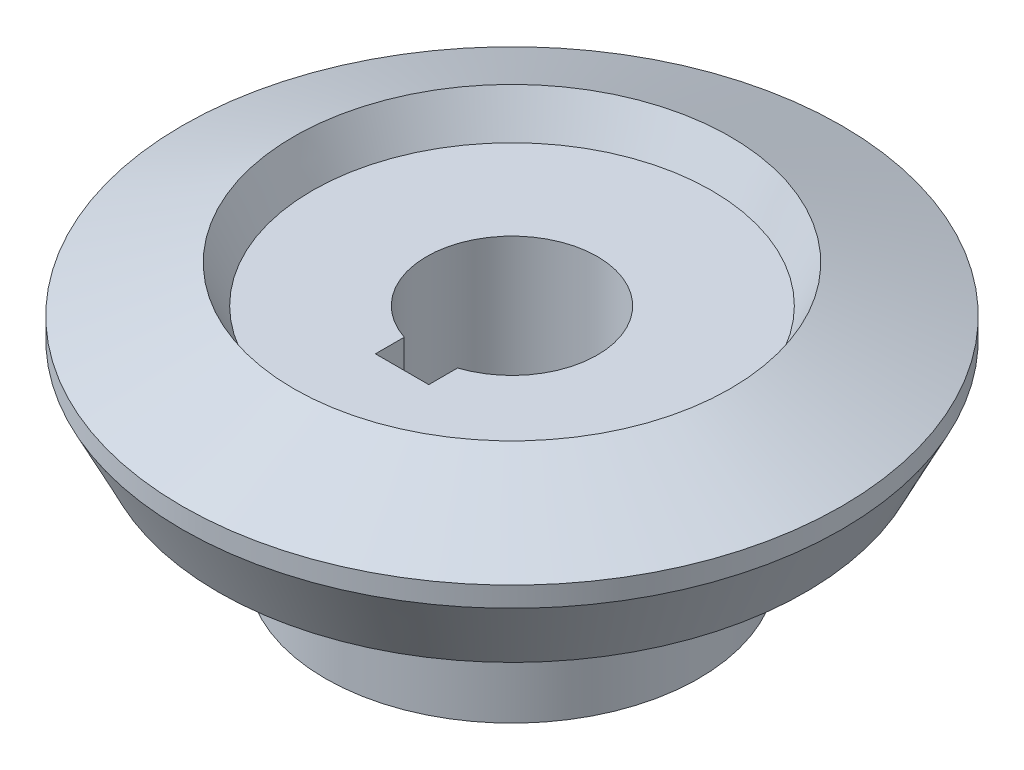
ISO-10303-21;
HEADER;
FILE_DESCRIPTION(('STEP AP214'),'2;1');
FILE_NAME('part.step','',(''),(''),'','','');
FILE_SCHEMA(('AUTOMOTIVE_DESIGN { 1 0 10303 214 1 1 1 1 }'));
ENDSEC;
DATA;
#1=APPLICATION_CONTEXT('core data for automotive mechanical design processes');
#2=APPLICATION_PROTOCOL_DEFINITION('international standard','automotive_design',2000,#1);
#3=PRODUCT_CONTEXT('',#1,'mechanical');
#4=PRODUCT('Part','Part','',(#3));
#5=PRODUCT_RELATED_PRODUCT_CATEGORY('part','',(#4));
#6=PRODUCT_DEFINITION_FORMATION('','',#4);
#7=PRODUCT_DEFINITION_CONTEXT('part definition',#1,'design');
#8=PRODUCT_DEFINITION('design','',#6,#7);
#9=PRODUCT_DEFINITION_SHAPE('','',#8);
#10=(LENGTH_UNIT() NAMED_UNIT(*) SI_UNIT(.MILLI.,.METRE.));
#11=(NAMED_UNIT(*) PLANE_ANGLE_UNIT() SI_UNIT($,.RADIAN.));
#12=(NAMED_UNIT(*) SI_UNIT($,.STERADIAN.) SOLID_ANGLE_UNIT());
#13=UNCERTAINTY_MEASURE_WITH_UNIT(LENGTH_MEASURE(1.E-05),#10,'distance_accuracy_value','');
#14=(GEOMETRIC_REPRESENTATION_CONTEXT(3) GLOBAL_UNCERTAINTY_ASSIGNED_CONTEXT((#13)) GLOBAL_UNIT_ASSIGNED_CONTEXT((#10,
#11,#12)) REPRESENTATION_CONTEXT('',''));
#15=CARTESIAN_POINT('',(0.,0.,0.));
#16=DIRECTION('',(0.,0.,1.));
#17=DIRECTION('',(1.,0.,0.));
#18=AXIS2_PLACEMENT_3D('',#15,#16,#17);
#19=CARTESIAN_POINT('',(0.,6.,0.));
#20=DIRECTION('',(0.,1.,0.));
#21=DIRECTION('',(0.,0.,1.));
#22=AXIS2_PLACEMENT_3D('',#19,#20,#21);
#23=CYLINDRICAL_SURFACE('',#22,17.5);
#24=CARTESIAN_POINT('',(0.,0.,0.));
#25=DIRECTION('',(0.,1.,0.));
#26=DIRECTION('',(0.,0.,1.));
#27=AXIS2_PLACEMENT_3D('',#24,#25,#26);
#28=CIRCLE('',#27,17.5);
#29=CARTESIAN_POINT('',(0.,0.,17.5));
#30=VERTEX_POINT('',#29);
#31=EDGE_CURVE('E20',#30,#30,#28,.F.);
#32=ORIENTED_EDGE('',*,*,#31,.F.);
#33=EDGE_LOOP('',(#32));
#34=FACE_BOUND('',#33,.T.);
#35=CARTESIAN_POINT('',(0.,12.,0.));
#36=DIRECTION('',(0.,1.,0.));
#37=DIRECTION('',(0.,0.,1.));
#38=AXIS2_PLACEMENT_3D('',#35,#36,#37);
#39=CIRCLE('',#38,17.5);
#40=CARTESIAN_POINT('',(0.,12.,17.5));
#41=VERTEX_POINT('',#40);
#42=EDGE_CURVE('E74',#41,#41,#39,.T.);
#43=ORIENTED_EDGE('',*,*,#42,.F.);
#44=EDGE_LOOP('',(#43));
#45=FACE_BOUND('',#44,.T.);
#46=ADVANCED_FACE('F17',(#34,#45),#23,.T.);
#47=CARTESIAN_POINT('',(17.5,0.,0.));
#48=DIRECTION('',(0.,-1.,0.));
#49=DIRECTION('',(0.,0.,-1.));
#50=AXIS2_PLACEMENT_3D('',#47,#48,#49);
#51=PLANE('',#50);
#52=DIRECTION('',(0.,0.,-1.));
#53=VECTOR('',#52,1.);
#54=CARTESIAN_POINT('',(2.5,0.,10.3));
#55=LINE('',#54,#53);
#56=CARTESIAN_POINT('',(2.5,0.,10.3));
#57=VERTEX_POINT('',#56);
#58=CARTESIAN_POINT('',(2.5,0.,7.59934207678533));
#59=VERTEX_POINT('',#58);
#60=EDGE_CURVE('E55',#57,#59,#55,.T.);
#61=ORIENTED_EDGE('',*,*,#60,.T.);
#62=CARTESIAN_POINT('',(0.,0.,0.));
#63=DIRECTION('',(0.,1.,0.));
#64=DIRECTION('',(0.,0.,1.));
#65=AXIS2_PLACEMENT_3D('',#62,#63,#64);
#66=CIRCLE('',#65,8.);
#67=CARTESIAN_POINT('',(-2.5,0.,7.59934207678533));
#68=VERTEX_POINT('',#67);
#69=EDGE_CURVE('E57',#59,#68,#66,.T.);
#70=ORIENTED_EDGE('',*,*,#69,.T.);
#71=DIRECTION('',(0.,0.,1.));
#72=VECTOR('',#71,1.);
#73=CARTESIAN_POINT('',(-2.5,0.,7.59934207678533));
#74=LINE('',#73,#72);
#75=CARTESIAN_POINT('',(-2.5,0.,10.3));
#76=VERTEX_POINT('',#75);
#77=EDGE_CURVE('E61',#68,#76,#74,.T.);
#78=ORIENTED_EDGE('',*,*,#77,.T.);
#79=DIRECTION('',(1.,0.,0.));
#80=VECTOR('',#79,1.);
#81=CARTESIAN_POINT('',(-2.5,0.,10.3));
#82=LINE('',#81,#80);
#83=EDGE_CURVE('E88',#76,#57,#82,.T.);
#84=ORIENTED_EDGE('',*,*,#83,.T.);
#85=EDGE_LOOP('',(#61,#70,#78,#84));
#86=FACE_BOUND('',#85,.T.);
#87=ORIENTED_EDGE('',*,*,#31,.T.);
#88=EDGE_LOOP('',(#87));
#89=FACE_BOUND('',#88,.T.);
#90=ADVANCED_FACE('F59',(#86,#89),#51,.T.);
#91=CARTESIAN_POINT('',(27.5,12.,0.));
#92=DIRECTION('',(0.,-1.,0.));
#93=DIRECTION('',(0.,0.,-1.));
#94=AXIS2_PLACEMENT_3D('',#91,#92,#93);
#95=PLANE('',#94);
#96=ORIENTED_EDGE('',*,*,#42,.T.);
#97=EDGE_LOOP('',(#96));
#98=FACE_BOUND('',#97,.T.);
#99=CARTESIAN_POINT('',(0.,12.,0.));
#100=DIRECTION('',(0.,1.,0.));
#101=DIRECTION('',(0.,0.,1.));
#102=AXIS2_PLACEMENT_3D('',#99,#100,#101);
#103=CIRCLE('',#102,27.5);
#104=CARTESIAN_POINT('',(0.,12.,27.5));
#105=VERTEX_POINT('',#104);
#106=EDGE_CURVE('E105',#105,#105,#103,.T.);
#107=ORIENTED_EDGE('',*,*,#106,.F.);
#108=EDGE_LOOP('',(#107));
#109=FACE_BOUND('',#108,.T.);
#110=ADVANCED_FACE('F119',(#98,#109),#95,.T.);
#111=CARTESIAN_POINT('',(-2.5,0.,7.59934207678533));
#112=DIRECTION('',(-1.,0.,0.));
#113=DIRECTION('',(0.,0.,1.));
#114=AXIS2_PLACEMENT_3D('',#111,#112,#113);
#115=PLANE('',#114);
#116=DIRECTION('',(0.,1.,0.));
#117=VECTOR('',#116,1.);
#118=CARTESIAN_POINT('',(-2.5,0.,10.3));
#119=LINE('',#118,#117);
#120=CARTESIAN_POINT('',(-2.5,21.5,10.3));
#121=VERTEX_POINT('',#120);
#122=EDGE_CURVE('E72',#121,#76,#119,.F.);
#123=ORIENTED_EDGE('',*,*,#122,.T.);
#124=ORIENTED_EDGE('',*,*,#77,.F.);
#125=DIRECTION('',(0.,1.,0.));
#126=VECTOR('',#125,1.);
#127=CARTESIAN_POINT('',(-2.5,0.,7.59934207678533));
#128=LINE('',#127,#126);
#129=CARTESIAN_POINT('',(-2.5,21.5,7.59934207678533));
#130=VERTEX_POINT('',#129);
#131=EDGE_CURVE('E66',#68,#130,#128,.T.);
#132=ORIENTED_EDGE('',*,*,#131,.T.);
#133=DIRECTION('',(0.,0.,1.));
#134=VECTOR('',#133,1.);
#135=CARTESIAN_POINT('',(-2.5,21.5,0.));
#136=LINE('',#135,#134);
#137=EDGE_CURVE('E104',#121,#130,#136,.F.);
#138=ORIENTED_EDGE('',*,*,#137,.F.);
#139=EDGE_LOOP('',(#123,#124,#132,#138));
#140=FACE_BOUND('',#139,.T.);
#141=ADVANCED_FACE('F69',(#140),#115,.F.);
#142=CARTESIAN_POINT('',(0.,0.,0.));
#143=DIRECTION('',(0.,1.,0.));
#144=DIRECTION('',(0.,0.,1.));
#145=AXIS2_PLACEMENT_3D('',#142,#143,#144);
#146=CYLINDRICAL_SURFACE('',#145,8.);
#147=ORIENTED_EDGE('',*,*,#131,.F.);
#148=ORIENTED_EDGE('',*,*,#69,.F.);
#149=DIRECTION('',(0.,1.,0.));
#150=VECTOR('',#149,1.);
#151=CARTESIAN_POINT('',(2.5,0.,7.59934207678533));
#152=LINE('',#151,#150);
#153=CARTESIAN_POINT('',(2.5,21.5,7.59934207678533));
#154=VERTEX_POINT('',#153);
#155=EDGE_CURVE('E81',#59,#154,#152,.T.);
#156=ORIENTED_EDGE('',*,*,#155,.T.);
#157=CARTESIAN_POINT('',(0.,21.5,0.));
#158=DIRECTION('',(0.,1.,0.));
#159=DIRECTION('',(0.,0.,1.));
#160=AXIS2_PLACEMENT_3D('',#157,#158,#159);
#161=CIRCLE('',#160,8.);
#162=EDGE_CURVE('E78',#130,#154,#161,.F.);
#163=ORIENTED_EDGE('',*,*,#162,.F.);
#164=EDGE_LOOP('',(#147,#148,#156,#163));
#165=FACE_BOUND('',#164,.T.);
#166=ADVANCED_FACE('F76',(#165),#146,.F.);
#167=CARTESIAN_POINT('',(2.5,0.,10.3));
#168=DIRECTION('',(1.,0.,0.));
#169=DIRECTION('',(0.,0.,-1.));
#170=AXIS2_PLACEMENT_3D('',#167,#168,#169);
#171=PLANE('',#170);
#172=ORIENTED_EDGE('',*,*,#155,.F.);
#173=ORIENTED_EDGE('',*,*,#60,.F.);
#174=DIRECTION('',(0.,1.,0.));
#175=VECTOR('',#174,1.);
#176=CARTESIAN_POINT('',(2.5,0.,10.3));
#177=LINE('',#176,#175);
#178=CARTESIAN_POINT('',(2.5,21.5,10.3));
#179=VERTEX_POINT('',#178);
#180=EDGE_CURVE('E35',#57,#179,#177,.T.);
#181=ORIENTED_EDGE('',*,*,#180,.T.);
#182=DIRECTION('',(0.,0.,1.));
#183=VECTOR('',#182,1.);
#184=CARTESIAN_POINT('',(2.5,21.5,0.));
#185=LINE('',#184,#183);
#186=EDGE_CURVE('E103',#154,#179,#185,.T.);
#187=ORIENTED_EDGE('',*,*,#186,.F.);
#188=EDGE_LOOP('',(#172,#173,#181,#187));
#189=FACE_BOUND('',#188,.T.);
#190=ADVANCED_FACE('F147',(#189),#171,.F.);
#191=CARTESIAN_POINT('',(-2.5,0.,10.3));
#192=DIRECTION('',(0.,0.,1.));
#193=DIRECTION('',(1.,0.,0.));
#194=AXIS2_PLACEMENT_3D('',#191,#192,#193);
#195=PLANE('',#194);
#196=ORIENTED_EDGE('',*,*,#180,.F.);
#197=ORIENTED_EDGE('',*,*,#83,.F.);
#198=ORIENTED_EDGE('',*,*,#122,.F.);
#199=DIRECTION('',(1.,0.,0.));
#200=VECTOR('',#199,1.);
#201=CARTESIAN_POINT('',(0.,21.5,10.3));
#202=LINE('',#201,#200);
#203=EDGE_CURVE('E163',#179,#121,#202,.F.);
#204=ORIENTED_EDGE('',*,*,#203,.F.);
#205=EDGE_LOOP('',(#196,#197,#198,#204));
#206=FACE_BOUND('',#205,.T.);
#207=ADVANCED_FACE('F143',(#206),#195,.F.);
#208=CARTESIAN_POINT('',(0.,18.790000348733,0.));
#209=DIRECTION('',(0.,1.,0.));
#210=DIRECTION('',(0.,0.,1.));
#211=AXIS2_PLACEMENT_3D('',#208,#209,#210);
#212=CONICAL_SURFACE('',#211,30.895,0.46364758845689);
#213=ORIENTED_EDGE('',*,*,#106,.T.);
#214=EDGE_LOOP('',(#213));
#215=FACE_BOUND('',#214,.T.);
#216=CARTESIAN_POINT('',(0.,18.790000348733,0.));
#217=DIRECTION('',(0.,1.,0.));
#218=DIRECTION('',(0.,0.,1.));
#219=AXIS2_PLACEMENT_3D('',#216,#217,#218);
#220=CIRCLE('',#219,30.895);
#221=CARTESIAN_POINT('',(0.,18.790000348733,30.895));
#222=VERTEX_POINT('',#221);
#223=EDGE_CURVE('E101',#222,#222,#220,.T.);
#224=ORIENTED_EDGE('',*,*,#223,.F.);
#225=EDGE_LOOP('',(#224));
#226=FACE_BOUND('',#225,.T.);
#227=ADVANCED_FACE('F139',(#215,#226),#212,.T.);
#228=CARTESIAN_POINT('',(0.,21.5,0.));
#229=DIRECTION('',(0.,1.,0.));
#230=DIRECTION('',(0.,0.,1.));
#231=AXIS2_PLACEMENT_3D('',#228,#229,#230);
#232=PLANE('',#231);
#233=ORIENTED_EDGE('',*,*,#186,.T.);
#234=ORIENTED_EDGE('',*,*,#203,.T.);
#235=ORIENTED_EDGE('',*,*,#137,.T.);
#236=ORIENTED_EDGE('',*,*,#162,.T.);
#237=EDGE_LOOP('',(#233,#234,#235,#236));
#238=FACE_BOUND('',#237,.T.);
#239=CARTESIAN_POINT('',(0.,21.5,0.));
#240=DIRECTION('',(0.,1.,0.));
#241=DIRECTION('',(0.,0.,1.));
#242=AXIS2_PLACEMENT_3D('',#239,#240,#241);
#243=CIRCLE('',#242,18.709329382792);
#244=CARTESIAN_POINT('',(0.,21.5,18.709329382792));
#245=VERTEX_POINT('',#244);
#246=EDGE_CURVE('E98',#245,#245,#243,.T.);
#247=ORIENTED_EDGE('',*,*,#246,.T.);
#248=EDGE_LOOP('',(#247));
#249=FACE_BOUND('',#248,.T.);
#250=ADVANCED_FACE('F135',(#238,#249),#232,.T.);
#251=CARTESIAN_POINT('',(0.,19.7323073917945,0.));
#252=DIRECTION('',(0.,1.,0.));
#253=DIRECTION('',(0.,0.,1.));
#254=AXIS2_PLACEMENT_3D('',#251,#252,#253);
#255=CYLINDRICAL_SURFACE('',#254,30.895);
#256=ORIENTED_EDGE('',*,*,#223,.T.);
#257=EDGE_LOOP('',(#256));
#258=FACE_BOUND('',#257,.T.);
#259=CARTESIAN_POINT('',(0.,20.674614434856,0.));
#260=DIRECTION('',(0.,-1.,0.));
#261=DIRECTION('',(1.,0.,0.));
#262=AXIS2_PLACEMENT_3D('',#259,#260,#261);
#263=CIRCLE('',#262,30.895);
#264=CARTESIAN_POINT('',(30.895,20.674614434856,0.));
#265=VERTEX_POINT('',#264);
#266=EDGE_CURVE('E26',#265,#265,#263,.F.);
#267=ORIENTED_EDGE('',*,*,#266,.F.);
#268=EDGE_LOOP('',(#267));
#269=FACE_BOUND('',#268,.T.);
#270=ADVANCED_FACE('F128',(#258,#269),#255,.T.);
#271=CARTESIAN_POINT('',(0.,25.,0.));
#272=DIRECTION('',(0.,1.,0.));
#273=DIRECTION('',(0.,0.,1.));
#274=AXIS2_PLACEMENT_3D('',#271,#272,#273);
#275=CONICAL_SURFACE('',#274,20.459329292913,0.463647588457035);
#276=CARTESIAN_POINT('',(0.,25.,0.));
#277=DIRECTION('',(0.,-1.,0.));
#278=DIRECTION('',(1.,0.,0.));
#279=AXIS2_PLACEMENT_3D('',#276,#277,#278);
#280=CIRCLE('',#279,20.459329292913);
#281=CARTESIAN_POINT('',(20.459329292913,25.,0.));
#282=VERTEX_POINT('',#281);
#283=EDGE_CURVE('E11',#282,#282,#280,.T.);
#284=ORIENTED_EDGE('',*,*,#283,.F.);
#285=EDGE_LOOP('',(#284));
#286=FACE_BOUND('',#285,.T.);
#287=ORIENTED_EDGE('',*,*,#246,.F.);
#288=EDGE_LOOP('',(#287));
#289=FACE_BOUND('',#288,.T.);
#290=ADVANCED_FACE('F122',(#286,#289),#275,.F.);
#291=CARTESIAN_POINT('',(0.,20.674614434856,0.));
#292=DIRECTION('',(0.,-1.,0.));
#293=DIRECTION('',(0.,0.,-1.));
#294=AXIS2_PLACEMENT_3D('',#291,#292,#293);
#295=CONICAL_SURFACE('',#294,30.895,1.17786913056296);
#296=ORIENTED_EDGE('',*,*,#283,.T.);
#297=EDGE_LOOP('',(#296));
#298=FACE_BOUND('',#297,.T.);
#299=ORIENTED_EDGE('',*,*,#266,.T.);
#300=EDGE_LOOP('',(#299));
#301=FACE_BOUND('',#300,.T.);
#302=ADVANCED_FACE('F120',(#298,#301),#295,.T.);
#303=CLOSED_SHELL('',(#46,#90,#110,#141,#166,#190,#207,#227,#250,#270,#290,#302));
#304=MANIFOLD_SOLID_BREP('B1',#303);
#305=ADVANCED_BREP_SHAPE_REPRESENTATION('',(#18,#304),#14);
#306=SHAPE_DEFINITION_REPRESENTATION(#9,#305);
ENDSEC;
END-ISO-10303-21;
